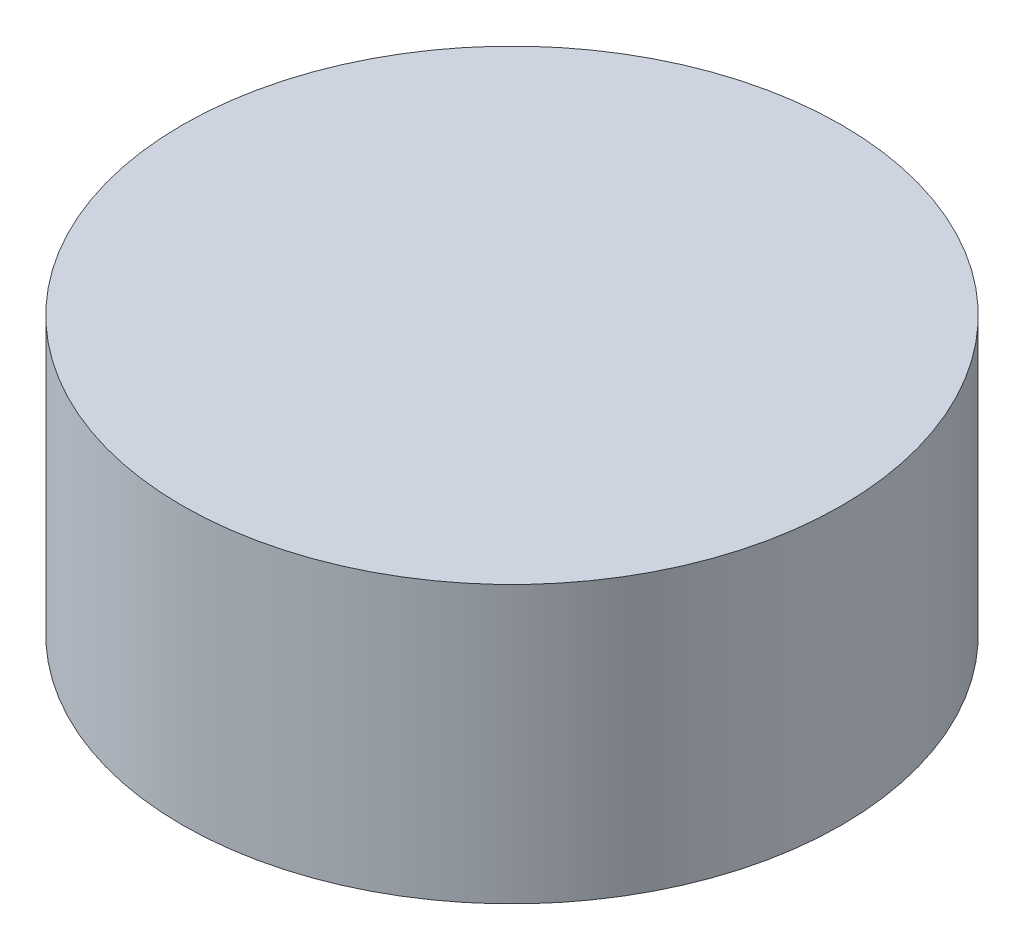
ISO-10303-21;
HEADER;
FILE_DESCRIPTION(('STEP AP214'),'2;1');
FILE_NAME('part.step','',(''),(''),'','','');
FILE_SCHEMA(('AUTOMOTIVE_DESIGN { 1 0 10303 214 1 1 1 1 }'));
ENDSEC;
DATA;
#1=APPLICATION_CONTEXT('core data for automotive mechanical design processes');
#2=APPLICATION_PROTOCOL_DEFINITION('international standard','automotive_design',2000,#1);
#3=PRODUCT_CONTEXT('',#1,'mechanical');
#4=PRODUCT('Part','Part','',(#3));
#5=PRODUCT_RELATED_PRODUCT_CATEGORY('part','',(#4));
#6=PRODUCT_DEFINITION_FORMATION('','',#4);
#7=PRODUCT_DEFINITION_CONTEXT('part definition',#1,'design');
#8=PRODUCT_DEFINITION('design','',#6,#7);
#9=PRODUCT_DEFINITION_SHAPE('','',#8);
#10=(LENGTH_UNIT() NAMED_UNIT(*) SI_UNIT(.MILLI.,.METRE.));
#11=(NAMED_UNIT(*) PLANE_ANGLE_UNIT() SI_UNIT($,.RADIAN.));
#12=(NAMED_UNIT(*) SI_UNIT($,.STERADIAN.) SOLID_ANGLE_UNIT());
#13=UNCERTAINTY_MEASURE_WITH_UNIT(LENGTH_MEASURE(1.E-05),#10,'distance_accuracy_value','');
#14=(GEOMETRIC_REPRESENTATION_CONTEXT(3) GLOBAL_UNCERTAINTY_ASSIGNED_CONTEXT((#13)) GLOBAL_UNIT_ASSIGNED_CONTEXT((#10,
#11,#12)) REPRESENTATION_CONTEXT('',''));
#15=CARTESIAN_POINT('',(0.,0.,0.));
#16=DIRECTION('',(0.,0.,1.));
#17=DIRECTION('',(1.,0.,0.));
#18=AXIS2_PLACEMENT_3D('',#15,#16,#17);
#19=CARTESIAN_POINT('',(-2765.,499.999999999999,0.));
#20=DIRECTION('',(0.,-1.,0.));
#21=DIRECTION('',(0.,0.,-1.));
#22=AXIS2_PLACEMENT_3D('',#19,#20,#21);
#23=PLANE('',#22);
#24=CARTESIAN_POINT('',(0.,500.,0.));
#25=DIRECTION('',(0.,1.,0.));
#26=DIRECTION('',(0.,0.,1.));
#27=AXIS2_PLACEMENT_3D('',#24,#25,#26);
#28=CIRCLE('',#27,2765.);
#29=CARTESIAN_POINT('',(0.,500.,2765.));
#30=VERTEX_POINT('',#29);
#31=EDGE_CURVE('E41',#30,#30,#28,.T.);
#32=ORIENTED_EDGE('',*,*,#31,.T.);
#33=EDGE_LOOP('',(#32));
#34=FACE_BOUND('',#33,.T.);
#35=CARTESIAN_POINT('',(0.,499.999999999999,0.));
#36=DIRECTION('',(0.,1.,0.));
#37=DIRECTION('',(0.,0.,1.));
#38=AXIS2_PLACEMENT_3D('',#35,#36,#37);
#39=CIRCLE('',#38,3750.);
#40=CARTESIAN_POINT('',(0.,499.999999999999,3750.));
#41=VERTEX_POINT('',#40);
#42=EDGE_CURVE('E10',#41,#41,#39,.T.);
#43=ORIENTED_EDGE('',*,*,#42,.F.);
#44=EDGE_LOOP('',(#43));
#45=FACE_BOUND('',#44,.T.);
#46=ADVANCED_FACE('F37',(#34,#45),#23,.T.);
#47=CARTESIAN_POINT('',(0.,3520.44,0.));
#48=DIRECTION('',(0.,1.,0.));
#49=DIRECTION('',(0.,0.,1.));
#50=AXIS2_PLACEMENT_3D('',#47,#48,#49);
#51=CYLINDRICAL_SURFACE('',#50,2765.);
#52=CARTESIAN_POINT('',(0.,2735.87422537166,0.));
#53=DIRECTION('',(0.,1.,0.));
#54=DIRECTION('',(0.,0.,1.));
#55=AXIS2_PLACEMENT_3D('',#52,#53,#54);
#56=CIRCLE('',#55,2765.);
#57=CARTESIAN_POINT('',(0.,2735.87422537166,2765.));
#58=VERTEX_POINT('',#57);
#59=EDGE_CURVE('E61',#58,#58,#56,.T.);
#60=ORIENTED_EDGE('',*,*,#59,.T.);
#61=EDGE_LOOP('',(#60));
#62=FACE_BOUND('',#61,.T.);
#63=ORIENTED_EDGE('',*,*,#31,.F.);
#64=EDGE_LOOP('',(#63));
#65=FACE_BOUND('',#64,.T.);
#66=ADVANCED_FACE('F39',(#62,#65),#51,.F.);
#67=CARTESIAN_POINT('',(-2133.6,3342.,0.));
#68=DIRECTION('',(0.,-1.,0.));
#69=DIRECTION('',(0.,0.,-1.));
#70=AXIS2_PLACEMENT_3D('',#67,#68,#69);
#71=PLANE('',#70);
#72=CARTESIAN_POINT('',(0.,3342.,0.));
#73=DIRECTION('',(0.,1.,0.));
#74=DIRECTION('',(0.,0.,1.));
#75=AXIS2_PLACEMENT_3D('',#72,#73,#74);
#76=CIRCLE('',#75,2133.6);
#77=CARTESIAN_POINT('',(0.,3342.,2133.6));
#78=VERTEX_POINT('',#77);
#79=EDGE_CURVE('E65',#78,#78,#76,.T.);
#80=ORIENTED_EDGE('',*,*,#79,.F.);
#81=EDGE_LOOP('',(#80));
#82=FACE_BOUND('',#81,.T.);
#83=ADVANCED_FACE('F91',(#82),#71,.T.);
#84=CARTESIAN_POINT('',(0.,2735.87422537166,0.));
#85=DIRECTION('',(0.,-1.,0.));
#86=DIRECTION('',(0.,0.,-1.));
#87=AXIS2_PLACEMENT_3D('',#84,#85,#86);
#88=CONICAL_SURFACE('',#87,2765.,0.805818515645779);
#89=ORIENTED_EDGE('',*,*,#79,.T.);
#90=EDGE_LOOP('',(#89));
#91=FACE_BOUND('',#90,.T.);
#92=ORIENTED_EDGE('',*,*,#59,.F.);
#93=EDGE_LOOP('',(#92));
#94=FACE_BOUND('',#93,.T.);
#95=ADVANCED_FACE('F83',(#91,#94),#88,.F.);
#96=CARTESIAN_POINT('',(0.,-2500.,7000.));
#97=DIRECTION('',(0.,-1.,0.));
#98=DIRECTION('',(0.,0.,-1.));
#99=AXIS2_PLACEMENT_3D('',#96,#97,#98);
#100=PLANE('',#99);
#101=CARTESIAN_POINT('',(0.,-2500.,0.));
#102=DIRECTION('',(0.,1.,0.));
#103=DIRECTION('',(0.,0.,1.));
#104=AXIS2_PLACEMENT_3D('',#101,#102,#103);
#105=CIRCLE('',#104,3750.);
#106=CARTESIAN_POINT('',(0.,-2500.,3750.));
#107=VERTEX_POINT('',#106);
#108=EDGE_CURVE('E53',#107,#107,#105,.T.);
#109=ORIENTED_EDGE('',*,*,#108,.T.);
#110=EDGE_LOOP('',(#109));
#111=FACE_BOUND('',#110,.T.);
#112=CARTESIAN_POINT('',(0.,-2500.,0.));
#113=DIRECTION('',(0.,1.,0.));
#114=DIRECTION('',(0.,0.,1.));
#115=AXIS2_PLACEMENT_3D('',#112,#113,#114);
#116=CIRCLE('',#115,7000.);
#117=CARTESIAN_POINT('',(0.,-2500.,7000.));
#118=VERTEX_POINT('',#117);
#119=EDGE_CURVE('E57',#118,#118,#116,.T.);
#120=ORIENTED_EDGE('',*,*,#119,.F.);
#121=EDGE_LOOP('',(#120));
#122=FACE_BOUND('',#121,.T.);
#123=ADVANCED_FACE('F80',(#111,#122),#100,.T.);
#124=CARTESIAN_POINT('',(0.,3520.44,0.));
#125=DIRECTION('',(0.,1.,0.));
#126=DIRECTION('',(0.,0.,1.));
#127=AXIS2_PLACEMENT_3D('',#124,#125,#126);
#128=CYLINDRICAL_SURFACE('',#127,3750.);
#129=ORIENTED_EDGE('',*,*,#42,.T.);
#130=EDGE_LOOP('',(#129));
#131=FACE_BOUND('',#130,.T.);
#132=ORIENTED_EDGE('',*,*,#108,.F.);
#133=EDGE_LOOP('',(#132));
#134=FACE_BOUND('',#133,.T.);
#135=ADVANCED_FACE('F82',(#131,#134),#128,.F.);
#136=CARTESIAN_POINT('',(0.,3372.,0.));
#137=DIRECTION('',(0.,1.,0.));
#138=DIRECTION('',(0.,0.,1.));
#139=AXIS2_PLACEMENT_3D('',#136,#137,#138);
#140=PLANE('',#139);
#141=CARTESIAN_POINT('',(0.,3372.,0.));
#142=DIRECTION('',(0.,1.,0.));
#143=DIRECTION('',(0.,0.,1.));
#144=AXIS2_PLACEMENT_3D('',#141,#142,#143);
#145=CIRCLE('',#144,7000.);
#146=CARTESIAN_POINT('',(0.,3372.,7000.));
#147=VERTEX_POINT('',#146);
#148=EDGE_CURVE('E51',#147,#147,#145,.T.);
#149=ORIENTED_EDGE('',*,*,#148,.T.);
#150=EDGE_LOOP('',(#149));
#151=FACE_BOUND('',#150,.T.);
#152=ADVANCED_FACE('F72',(#151),#140,.T.);
#153=CARTESIAN_POINT('',(0.,3520.44,0.));
#154=DIRECTION('',(0.,1.,0.));
#155=DIRECTION('',(0.,0.,1.));
#156=AXIS2_PLACEMENT_3D('',#153,#154,#155);
#157=CYLINDRICAL_SURFACE('',#156,7000.);
#158=ORIENTED_EDGE('',*,*,#148,.F.);
#159=EDGE_LOOP('',(#158));
#160=FACE_BOUND('',#159,.T.);
#161=ORIENTED_EDGE('',*,*,#119,.T.);
#162=EDGE_LOOP('',(#161));
#163=FACE_BOUND('',#162,.T.);
#164=ADVANCED_FACE('F74',(#160,#163),#157,.T.);
#165=CLOSED_SHELL('',(#46,#66,#83,#95,#123,#135,#152,#164));
#166=MANIFOLD_SOLID_BREP('B2',#165);
#167=ADVANCED_BREP_SHAPE_REPRESENTATION('',(#18,#166),#14);
#168=SHAPE_DEFINITION_REPRESENTATION(#9,#167);
ENDSEC;
END-ISO-10303-21;
